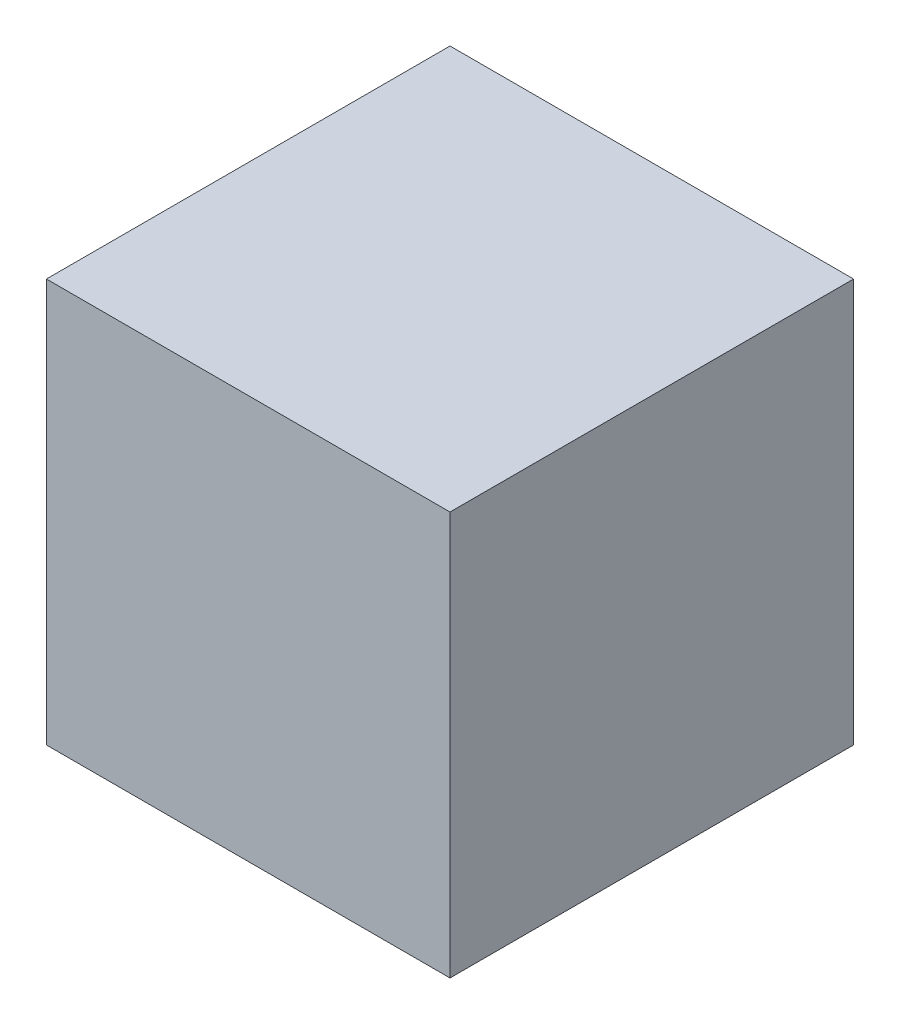
ISO-10303-21;
HEADER;
FILE_DESCRIPTION(('STEP AP214'),'2;1');
FILE_NAME('part.step','',(''),(''),'','','');
FILE_SCHEMA(('AUTOMOTIVE_DESIGN { 1 0 10303 214 1 1 1 1 }'));
ENDSEC;
DATA;
#1=APPLICATION_CONTEXT('core data for automotive mechanical design processes');
#2=APPLICATION_PROTOCOL_DEFINITION('international standard','automotive_design',2000,#1);
#3=PRODUCT_CONTEXT('',#1,'mechanical');
#4=PRODUCT('Part','Part','',(#3));
#5=PRODUCT_RELATED_PRODUCT_CATEGORY('part','',(#4));
#6=PRODUCT_DEFINITION_FORMATION('','',#4);
#7=PRODUCT_DEFINITION_CONTEXT('part definition',#1,'design');
#8=PRODUCT_DEFINITION('design','',#6,#7);
#9=PRODUCT_DEFINITION_SHAPE('','',#8);
#10=(LENGTH_UNIT() NAMED_UNIT(*) SI_UNIT(.MILLI.,.METRE.));
#11=(NAMED_UNIT(*) PLANE_ANGLE_UNIT() SI_UNIT($,.RADIAN.));
#12=(NAMED_UNIT(*) SI_UNIT($,.STERADIAN.) SOLID_ANGLE_UNIT());
#13=UNCERTAINTY_MEASURE_WITH_UNIT(LENGTH_MEASURE(1.E-05),#10,'distance_accuracy_value','');
#14=(GEOMETRIC_REPRESENTATION_CONTEXT(3) GLOBAL_UNCERTAINTY_ASSIGNED_CONTEXT((#13)) GLOBAL_UNIT_ASSIGNED_CONTEXT((#10,
#11,#12)) REPRESENTATION_CONTEXT('',''));
#15=CARTESIAN_POINT('',(0.,0.,0.));
#16=DIRECTION('',(0.,0.,1.));
#17=DIRECTION('',(1.,0.,0.));
#18=AXIS2_PLACEMENT_3D('',#15,#16,#17);
#19=CARTESIAN_POINT('',(-180.777931034483,273.05,-161.476120689655));
#20=DIRECTION('',(1.,0.,0.));
#21=DIRECTION('',(0.,0.,-1.));
#22=AXIS2_PLACEMENT_3D('',#19,#20,#21);
#23=PLANE('',#22);
#24=DIRECTION('',(0.,0.,1.));
#25=VECTOR('',#24,1.);
#26=CARTESIAN_POINT('',(-180.777931034483,0.,-161.476120689655));
#27=LINE('',#26,#25);
#28=CARTESIAN_POINT('',(-180.777931034483,0.,-161.476120689655));
#29=VERTEX_POINT('',#28);
#30=CARTESIAN_POINT('',(-180.777931034483,0.,111.573879310345));
#31=VERTEX_POINT('',#30);
#32=EDGE_CURVE('E96',#29,#31,#27,.T.);
#33=ORIENTED_EDGE('',*,*,#32,.T.);
#34=DIRECTION('',(0.,-1.,0.));
#35=VECTOR('',#34,1.);
#36=CARTESIAN_POINT('',(-180.777931034483,273.05,111.573879310345));
#37=LINE('',#36,#35);
#38=CARTESIAN_POINT('',(-180.777931034483,273.05,111.573879310345));
#39=VERTEX_POINT('',#38);
#40=EDGE_CURVE('E11',#39,#31,#37,.T.);
#41=ORIENTED_EDGE('',*,*,#40,.F.);
#42=DIRECTION('',(0.,0.,1.));
#43=VECTOR('',#42,1.);
#44=CARTESIAN_POINT('',(-180.777931034483,273.05,-161.476120689655));
#45=LINE('',#44,#43);
#46=CARTESIAN_POINT('',(-180.777931034483,273.05,-161.476120689655));
#47=VERTEX_POINT('',#46);
#48=EDGE_CURVE('E84',#47,#39,#45,.T.);
#49=ORIENTED_EDGE('',*,*,#48,.F.);
#50=DIRECTION('',(0.,-1.,0.));
#51=VECTOR('',#50,1.);
#52=CARTESIAN_POINT('',(-180.777931034483,273.05,-161.476120689655));
#53=LINE('',#52,#51);
#54=EDGE_CURVE('E92',#47,#29,#53,.T.);
#55=ORIENTED_EDGE('',*,*,#54,.T.);
#56=EDGE_LOOP('',(#33,#41,#49,#55));
#57=FACE_BOUND('',#56,.T.);
#58=ADVANCED_FACE('F33',(#57),#23,.F.);
#59=CARTESIAN_POINT('',(-180.777931034483,273.05,111.573879310345));
#60=DIRECTION('',(0.,0.,-1.));
#61=DIRECTION('',(-1.,0.,0.));
#62=AXIS2_PLACEMENT_3D('',#59,#60,#61);
#63=PLANE('',#62);
#64=DIRECTION('',(1.,0.,0.));
#65=VECTOR('',#64,1.);
#66=CARTESIAN_POINT('',(-180.777931034483,0.,111.573879310345));
#67=LINE('',#66,#65);
#68=CARTESIAN_POINT('',(92.2720689655172,0.,111.573879310345));
#69=VERTEX_POINT('',#68);
#70=EDGE_CURVE('E88',#31,#69,#67,.T.);
#71=ORIENTED_EDGE('',*,*,#70,.T.);
#72=DIRECTION('',(0.,-1.,0.));
#73=VECTOR('',#72,1.);
#74=CARTESIAN_POINT('',(92.2720689655172,273.05,111.573879310345));
#75=LINE('',#74,#73);
#76=CARTESIAN_POINT('',(92.2720689655172,273.05,111.573879310345));
#77=VERTEX_POINT('',#76);
#78=EDGE_CURVE('E41',#77,#69,#75,.T.);
#79=ORIENTED_EDGE('',*,*,#78,.F.);
#80=DIRECTION('',(1.,0.,0.));
#81=VECTOR('',#80,1.);
#82=CARTESIAN_POINT('',(-180.777931034483,273.05,111.573879310345));
#83=LINE('',#82,#81);
#84=EDGE_CURVE('E79',#39,#77,#83,.T.);
#85=ORIENTED_EDGE('',*,*,#84,.F.);
#86=ORIENTED_EDGE('',*,*,#40,.T.);
#87=EDGE_LOOP('',(#71,#79,#85,#86));
#88=FACE_BOUND('',#87,.T.);
#89=ADVANCED_FACE('F87',(#88),#63,.F.);
#90=CARTESIAN_POINT('',(92.2720689655171,273.05,-161.476120689655));
#91=DIRECTION('',(-1.,0.,0.));
#92=DIRECTION('',(0.,0.,1.));
#93=AXIS2_PLACEMENT_3D('',#90,#91,#92);
#94=PLANE('',#93);
#95=DIRECTION('',(0.,0.,-1.));
#96=VECTOR('',#95,1.);
#97=CARTESIAN_POINT('',(92.2720689655171,0.,-161.476120689655));
#98=LINE('',#97,#96);
#99=CARTESIAN_POINT('',(92.2720689655171,0.,-161.476120689655));
#100=VERTEX_POINT('',#99);
#101=EDGE_CURVE('E66',#69,#100,#98,.T.);
#102=ORIENTED_EDGE('',*,*,#101,.T.);
#103=DIRECTION('',(0.,-1.,0.));
#104=VECTOR('',#103,1.);
#105=CARTESIAN_POINT('',(92.2720689655171,273.05,-161.476120689655));
#106=LINE('',#105,#104);
#107=CARTESIAN_POINT('',(92.2720689655171,273.05,-161.476120689655));
#108=VERTEX_POINT('',#107);
#109=EDGE_CURVE('E89',#108,#100,#106,.T.);
#110=ORIENTED_EDGE('',*,*,#109,.F.);
#111=DIRECTION('',(0.,0.,-1.));
#112=VECTOR('',#111,1.);
#113=CARTESIAN_POINT('',(92.2720689655171,273.05,-161.476120689655));
#114=LINE('',#113,#112);
#115=EDGE_CURVE('E82',#77,#108,#114,.T.);
#116=ORIENTED_EDGE('',*,*,#115,.F.);
#117=ORIENTED_EDGE('',*,*,#78,.T.);
#118=EDGE_LOOP('',(#102,#110,#116,#117));
#119=FACE_BOUND('',#118,.T.);
#120=ADVANCED_FACE('F90',(#119),#94,.F.);
#121=CARTESIAN_POINT('',(-180.777931034483,273.05,-161.476120689655));
#122=DIRECTION('',(0.,0.,1.));
#123=DIRECTION('',(1.,0.,0.));
#124=AXIS2_PLACEMENT_3D('',#121,#122,#123);
#125=PLANE('',#124);
#126=DIRECTION('',(-1.,0.,0.));
#127=VECTOR('',#126,1.);
#128=CARTESIAN_POINT('',(-180.777931034483,0.,-161.476120689655));
#129=LINE('',#128,#127);
#130=EDGE_CURVE('E72',#100,#29,#129,.T.);
#131=ORIENTED_EDGE('',*,*,#130,.T.);
#132=ORIENTED_EDGE('',*,*,#54,.F.);
#133=DIRECTION('',(-1.,0.,0.));
#134=VECTOR('',#133,1.);
#135=CARTESIAN_POINT('',(-180.777931034483,273.05,-161.476120689655));
#136=LINE('',#135,#134);
#137=EDGE_CURVE('E49',#108,#47,#136,.T.);
#138=ORIENTED_EDGE('',*,*,#137,.F.);
#139=ORIENTED_EDGE('',*,*,#109,.T.);
#140=EDGE_LOOP('',(#131,#132,#138,#139));
#141=FACE_BOUND('',#140,.T.);
#142=ADVANCED_FACE('F103',(#141),#125,.F.);
#143=CARTESIAN_POINT('',(0.,273.05,0.));
#144=DIRECTION('',(0.,1.,0.));
#145=DIRECTION('',(0.,0.,1.));
#146=AXIS2_PLACEMENT_3D('',#143,#144,#145);
#147=PLANE('',#146);
#148=ORIENTED_EDGE('',*,*,#48,.T.);
#149=ORIENTED_EDGE('',*,*,#84,.T.);
#150=ORIENTED_EDGE('',*,*,#115,.T.);
#151=ORIENTED_EDGE('',*,*,#137,.T.);
#152=EDGE_LOOP('',(#148,#149,#150,#151));
#153=FACE_BOUND('',#152,.T.);
#154=ADVANCED_FACE('F80',(#153),#147,.T.);
#155=CARTESIAN_POINT('',(0.,0.,0.));
#156=DIRECTION('',(0.,1.,0.));
#157=DIRECTION('',(0.,0.,1.));
#158=AXIS2_PLACEMENT_3D('',#155,#156,#157);
#159=PLANE('',#158);
#160=ORIENTED_EDGE('',*,*,#32,.F.);
#161=ORIENTED_EDGE('',*,*,#130,.F.);
#162=ORIENTED_EDGE('',*,*,#101,.F.);
#163=ORIENTED_EDGE('',*,*,#70,.F.);
#164=EDGE_LOOP('',(#160,#161,#162,#163));
#165=FACE_BOUND('',#164,.T.);
#166=ADVANCED_FACE('F106',(#165),#159,.F.);
#167=CLOSED_SHELL('',(#58,#89,#120,#142,#154,#166));
#168=MANIFOLD_SOLID_BREP('B2',#167);
#169=ADVANCED_BREP_SHAPE_REPRESENTATION('',(#18,#168),#14);
#170=SHAPE_DEFINITION_REPRESENTATION(#9,#169);
ENDSEC;
END-ISO-10303-21;
